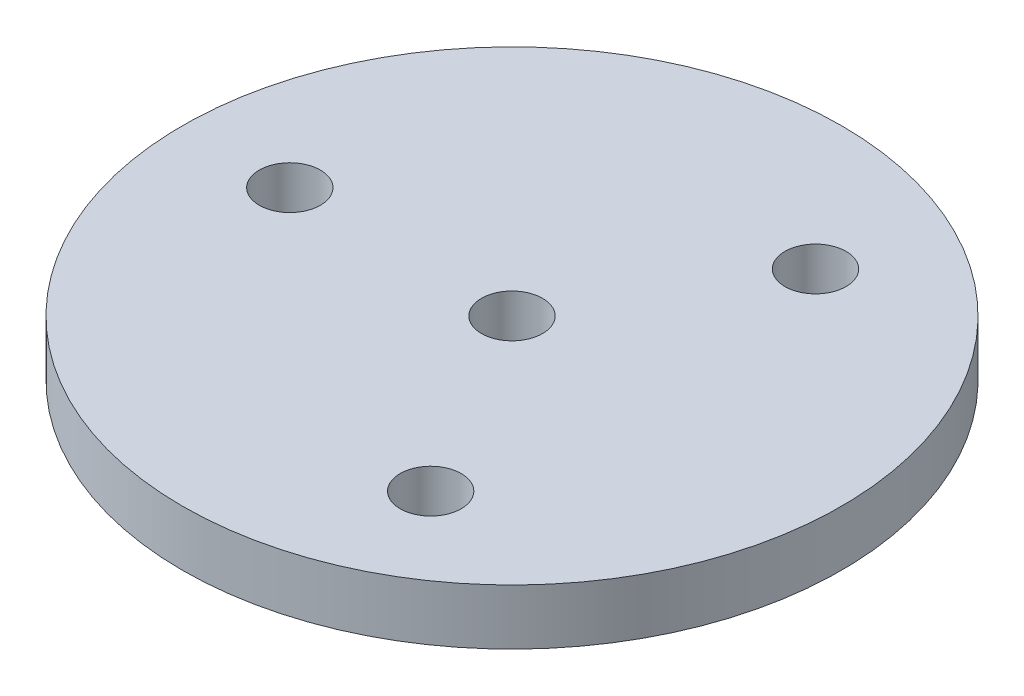
ISO-10303-21;
HEADER;
FILE_DESCRIPTION(('STEP AP214'),'2;1');
FILE_NAME('part.step','',(''),(''),'','','');
FILE_SCHEMA(('AUTOMOTIVE_DESIGN { 1 0 10303 214 1 1 1 1 }'));
ENDSEC;
DATA;
#1=APPLICATION_CONTEXT('core data for automotive mechanical design processes');
#2=APPLICATION_PROTOCOL_DEFINITION('international standard','automotive_design',2000,#1);
#3=PRODUCT_CONTEXT('',#1,'mechanical');
#4=PRODUCT('Part','Part','',(#3));
#5=PRODUCT_RELATED_PRODUCT_CATEGORY('part','',(#4));
#6=PRODUCT_DEFINITION_FORMATION('','',#4);
#7=PRODUCT_DEFINITION_CONTEXT('part definition',#1,'design');
#8=PRODUCT_DEFINITION('design','',#6,#7);
#9=PRODUCT_DEFINITION_SHAPE('','',#8);
#10=(LENGTH_UNIT() NAMED_UNIT(*) SI_UNIT(.MILLI.,.METRE.));
#11=(NAMED_UNIT(*) PLANE_ANGLE_UNIT() SI_UNIT($,.RADIAN.));
#12=(NAMED_UNIT(*) SI_UNIT($,.STERADIAN.) SOLID_ANGLE_UNIT());
#13=UNCERTAINTY_MEASURE_WITH_UNIT(LENGTH_MEASURE(1.E-05),#10,'distance_accuracy_value','');
#14=(GEOMETRIC_REPRESENTATION_CONTEXT(3) GLOBAL_UNCERTAINTY_ASSIGNED_CONTEXT((#13)) GLOBAL_UNIT_ASSIGNED_CONTEXT((#10,
#11,#12)) REPRESENTATION_CONTEXT('',''));
#15=CARTESIAN_POINT('',(0.,0.,0.));
#16=DIRECTION('',(0.,0.,1.));
#17=DIRECTION('',(1.,0.,0.));
#18=AXIS2_PLACEMENT_3D('',#15,#16,#17);
#19=CARTESIAN_POINT('',(0.,3.,1.));
#20=DIRECTION('',(0.,-1.,0.));
#21=DIRECTION('',(0.,0.,-1.));
#22=AXIS2_PLACEMENT_3D('',#19,#20,#21);
#23=PLANE('',#22);
#24=CARTESIAN_POINT('',(0.,3.,0.));
#25=DIRECTION('',(0.,1.,0.));
#26=DIRECTION('',(0.,0.,1.));
#27=AXIS2_PLACEMENT_3D('',#24,#25,#26);
#28=CIRCLE('',#27,1.64999999999999);
#29=CARTESIAN_POINT('',(0.,3.,1.64999999999999));
#30=VERTEX_POINT('',#29);
#31=EDGE_CURVE('E68',#30,#30,#28,.T.);
#32=ORIENTED_EDGE('',*,*,#31,.F.);
#33=EDGE_LOOP('',(#32));
#34=FACE_BOUND('',#33,.T.);
#35=CARTESIAN_POINT('',(6.00000000000005,3.,-10.3923048454132));
#36=DIRECTION('',(0.,1.,0.));
#37=DIRECTION('',(0.,0.,1.));
#38=AXIS2_PLACEMENT_3D('',#35,#36,#37);
#39=CIRCLE('',#38,1.64999999999999);
#40=CARTESIAN_POINT('',(6.00000000000005,3.,-8.74230484541325));
#41=VERTEX_POINT('',#40);
#42=EDGE_CURVE('E62',#41,#41,#39,.T.);
#43=ORIENTED_EDGE('',*,*,#42,.F.);
#44=EDGE_LOOP('',(#43));
#45=FACE_BOUND('',#44,.T.);
#46=CARTESIAN_POINT('',(-12.,3.,0.));
#47=DIRECTION('',(0.,1.,0.));
#48=DIRECTION('',(0.,0.,1.));
#49=AXIS2_PLACEMENT_3D('',#46,#47,#48);
#50=CIRCLE('',#49,1.64999999999999);
#51=CARTESIAN_POINT('',(-12.,3.,1.64999999999999));
#52=VERTEX_POINT('',#51);
#53=EDGE_CURVE('E56',#52,#52,#50,.T.);
#54=ORIENTED_EDGE('',*,*,#53,.F.);
#55=EDGE_LOOP('',(#54));
#56=FACE_BOUND('',#55,.T.);
#57=CARTESIAN_POINT('',(5.9999999999999,3.,10.3923048454133));
#58=DIRECTION('',(0.,1.,0.));
#59=DIRECTION('',(0.,0.,1.));
#60=AXIS2_PLACEMENT_3D('',#57,#58,#59);
#61=CIRCLE('',#60,1.64999999999999);
#62=CARTESIAN_POINT('',(5.9999999999999,3.,12.0423048454133));
#63=VERTEX_POINT('',#62);
#64=EDGE_CURVE('E48',#63,#63,#61,.T.);
#65=ORIENTED_EDGE('',*,*,#64,.F.);
#66=EDGE_LOOP('',(#65));
#67=FACE_BOUND('',#66,.T.);
#68=CARTESIAN_POINT('',(0.,3.,0.));
#69=DIRECTION('',(0.,-1.,0.));
#70=DIRECTION('',(0.,0.,-1.));
#71=AXIS2_PLACEMENT_3D('',#68,#69,#70);
#72=CIRCLE('',#71,17.8);
#73=CARTESIAN_POINT('',(0.,3.,-17.8));
#74=VERTEX_POINT('',#73);
#75=EDGE_CURVE('E10',#74,#74,#72,.T.);
#76=ORIENTED_EDGE('',*,*,#75,.F.);
#77=EDGE_LOOP('',(#76));
#78=FACE_BOUND('',#77,.T.);
#79=ADVANCED_FACE('F34',(#34,#45,#56,#67,#78),#23,.F.);
#80=CARTESIAN_POINT('',(0.,0.,0.));
#81=DIRECTION('',(0.,-1.,0.));
#82=DIRECTION('',(0.,0.,-1.));
#83=AXIS2_PLACEMENT_3D('',#80,#81,#82);
#84=CYLINDRICAL_SURFACE('',#83,17.8);
#85=CARTESIAN_POINT('',(0.,0.,0.));
#86=DIRECTION('',(0.,-1.,0.));
#87=DIRECTION('',(0.,0.,-1.));
#88=AXIS2_PLACEMENT_3D('',#85,#86,#87);
#89=CIRCLE('',#88,17.8);
#90=CARTESIAN_POINT('',(0.,0.,-17.8));
#91=VERTEX_POINT('',#90);
#92=EDGE_CURVE('E40',#91,#91,#89,.T.);
#93=ORIENTED_EDGE('',*,*,#92,.F.);
#94=EDGE_LOOP('',(#93));
#95=FACE_BOUND('',#94,.T.);
#96=ORIENTED_EDGE('',*,*,#75,.T.);
#97=EDGE_LOOP('',(#96));
#98=FACE_BOUND('',#97,.T.);
#99=ADVANCED_FACE('F76',(#95,#98),#84,.T.);
#100=CARTESIAN_POINT('',(0.,0.,1.));
#101=DIRECTION('',(0.,1.,0.));
#102=DIRECTION('',(0.,0.,1.));
#103=AXIS2_PLACEMENT_3D('',#100,#101,#102);
#104=PLANE('',#103);
#105=CARTESIAN_POINT('',(0.,0.,0.));
#106=DIRECTION('',(0.,1.,0.));
#107=DIRECTION('',(0.,0.,1.));
#108=AXIS2_PLACEMENT_3D('',#105,#106,#107);
#109=CIRCLE('',#108,1.65);
#110=CARTESIAN_POINT('',(0.,0.,1.65));
#111=VERTEX_POINT('',#110);
#112=EDGE_CURVE('E65',#111,#111,#109,.T.);
#113=ORIENTED_EDGE('',*,*,#112,.T.);
#114=EDGE_LOOP('',(#113));
#115=FACE_BOUND('',#114,.T.);
#116=CARTESIAN_POINT('',(6.00000000000005,0.,-10.3923048454132));
#117=DIRECTION('',(0.,1.,0.));
#118=DIRECTION('',(0.,0.,1.));
#119=AXIS2_PLACEMENT_3D('',#116,#117,#118);
#120=CIRCLE('',#119,1.65);
#121=CARTESIAN_POINT('',(6.00000000000005,0.,-8.74230484541324));
#122=VERTEX_POINT('',#121);
#123=EDGE_CURVE('E59',#122,#122,#120,.T.);
#124=ORIENTED_EDGE('',*,*,#123,.T.);
#125=EDGE_LOOP('',(#124));
#126=FACE_BOUND('',#125,.T.);
#127=CARTESIAN_POINT('',(-12.,0.,0.));
#128=DIRECTION('',(0.,1.,0.));
#129=DIRECTION('',(0.,0.,1.));
#130=AXIS2_PLACEMENT_3D('',#127,#128,#129);
#131=CIRCLE('',#130,1.65);
#132=CARTESIAN_POINT('',(-12.,0.,1.65));
#133=VERTEX_POINT('',#132);
#134=EDGE_CURVE('E53',#133,#133,#131,.T.);
#135=ORIENTED_EDGE('',*,*,#134,.T.);
#136=EDGE_LOOP('',(#135));
#137=FACE_BOUND('',#136,.T.);
#138=CARTESIAN_POINT('',(5.9999999999999,0.,10.3923048454133));
#139=DIRECTION('',(0.,1.,0.));
#140=DIRECTION('',(0.,0.,1.));
#141=AXIS2_PLACEMENT_3D('',#138,#139,#140);
#142=CIRCLE('',#141,1.65);
#143=CARTESIAN_POINT('',(5.9999999999999,0.,12.0423048454133));
#144=VERTEX_POINT('',#143);
#145=EDGE_CURVE('E44',#144,#144,#142,.T.);
#146=ORIENTED_EDGE('',*,*,#145,.T.);
#147=EDGE_LOOP('',(#146));
#148=FACE_BOUND('',#147,.T.);
#149=ORIENTED_EDGE('',*,*,#92,.T.);
#150=EDGE_LOOP('',(#149));
#151=FACE_BOUND('',#150,.T.);
#152=ADVANCED_FACE('F87',(#115,#126,#137,#148,#151),#104,.F.);
#153=CARTESIAN_POINT('',(5.9999999999999,3.,10.3923048454133));
#154=DIRECTION('',(0.,1.,0.));
#155=DIRECTION('',(0.,0.,1.));
#156=AXIS2_PLACEMENT_3D('',#153,#154,#155);
#157=CYLINDRICAL_SURFACE('',#156,1.64999999999999);
#158=ORIENTED_EDGE('',*,*,#145,.F.);
#159=EDGE_LOOP('',(#158));
#160=FACE_BOUND('',#159,.T.);
#161=ORIENTED_EDGE('',*,*,#64,.T.);
#162=EDGE_LOOP('',(#161));
#163=FACE_BOUND('',#162,.T.);
#164=ADVANCED_FACE('F84',(#160,#163),#157,.F.);
#165=CARTESIAN_POINT('',(-12.,3.,0.));
#166=DIRECTION('',(0.,1.,0.));
#167=DIRECTION('',(0.,0.,1.));
#168=AXIS2_PLACEMENT_3D('',#165,#166,#167);
#169=CYLINDRICAL_SURFACE('',#168,1.64999999999999);
#170=ORIENTED_EDGE('',*,*,#134,.F.);
#171=EDGE_LOOP('',(#170));
#172=FACE_BOUND('',#171,.T.);
#173=ORIENTED_EDGE('',*,*,#53,.T.);
#174=EDGE_LOOP('',(#173));
#175=FACE_BOUND('',#174,.T.);
#176=ADVANCED_FACE('F86',(#172,#175),#169,.F.);
#177=CARTESIAN_POINT('',(6.00000000000005,3.,-10.3923048454132));
#178=DIRECTION('',(0.,1.,0.));
#179=DIRECTION('',(0.,0.,1.));
#180=AXIS2_PLACEMENT_3D('',#177,#178,#179);
#181=CYLINDRICAL_SURFACE('',#180,1.64999999999999);
#182=ORIENTED_EDGE('',*,*,#123,.F.);
#183=EDGE_LOOP('',(#182));
#184=FACE_BOUND('',#183,.T.);
#185=ORIENTED_EDGE('',*,*,#42,.T.);
#186=EDGE_LOOP('',(#185));
#187=FACE_BOUND('',#186,.T.);
#188=ADVANCED_FACE('F94',(#184,#187),#181,.F.);
#189=CARTESIAN_POINT('',(0.,3.,0.));
#190=DIRECTION('',(0.,1.,0.));
#191=DIRECTION('',(0.,0.,1.));
#192=AXIS2_PLACEMENT_3D('',#189,#190,#191);
#193=CYLINDRICAL_SURFACE('',#192,1.64999999999999);
#194=ORIENTED_EDGE('',*,*,#112,.F.);
#195=EDGE_LOOP('',(#194));
#196=FACE_BOUND('',#195,.T.);
#197=ORIENTED_EDGE('',*,*,#31,.T.);
#198=EDGE_LOOP('',(#197));
#199=FACE_BOUND('',#198,.T.);
#200=ADVANCED_FACE('F72',(#196,#199),#193,.F.);
#201=CLOSED_SHELL('',(#79,#99,#152,#164,#176,#188,#200));
#202=MANIFOLD_SOLID_BREP('B2',#201);
#203=ADVANCED_BREP_SHAPE_REPRESENTATION('',(#18,#202),#14);
#204=SHAPE_DEFINITION_REPRESENTATION(#9,#203);
ENDSEC;
END-ISO-10303-21;
